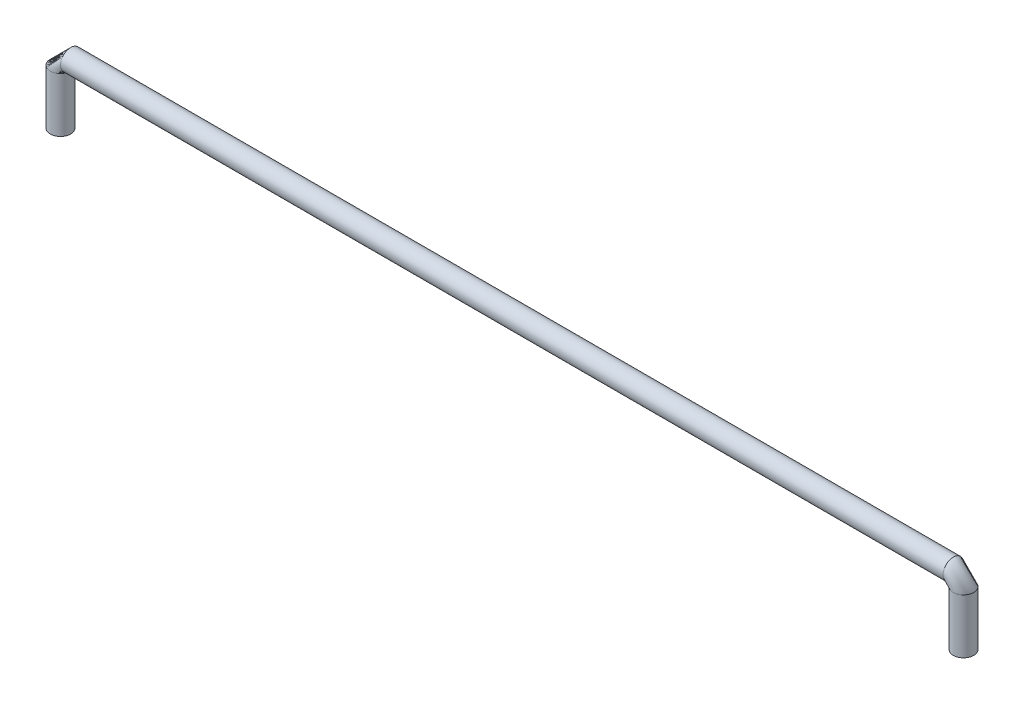
ISO-10303-21;
HEADER;
FILE_DESCRIPTION(('STEP AP214'),'2;1');
FILE_NAME('part.step','',(''),(''),'','','');
FILE_SCHEMA(('AUTOMOTIVE_DESIGN { 1 0 10303 214 1 1 1 1 }'));
ENDSEC;
DATA;
#1=APPLICATION_CONTEXT('core data for automotive mechanical design processes');
#2=APPLICATION_PROTOCOL_DEFINITION('international standard','automotive_design',2000,#1);
#3=PRODUCT_CONTEXT('',#1,'mechanical');
#4=PRODUCT('Part','Part','',(#3));
#5=PRODUCT_RELATED_PRODUCT_CATEGORY('part','',(#4));
#6=PRODUCT_DEFINITION_FORMATION('','',#4);
#7=PRODUCT_DEFINITION_CONTEXT('part definition',#1,'design');
#8=PRODUCT_DEFINITION('design','',#6,#7);
#9=PRODUCT_DEFINITION_SHAPE('','',#8);
#10=(LENGTH_UNIT() NAMED_UNIT(*) SI_UNIT(.MILLI.,.METRE.));
#11=(NAMED_UNIT(*) PLANE_ANGLE_UNIT() SI_UNIT($,.RADIAN.));
#12=(NAMED_UNIT(*) SI_UNIT($,.STERADIAN.) SOLID_ANGLE_UNIT());
#13=UNCERTAINTY_MEASURE_WITH_UNIT(LENGTH_MEASURE(1.E-05),#10,'distance_accuracy_value','');
#14=(GEOMETRIC_REPRESENTATION_CONTEXT(3) GLOBAL_UNCERTAINTY_ASSIGNED_CONTEXT((#13)) GLOBAL_UNIT_ASSIGNED_CONTEXT((#10,
#11,#12)) REPRESENTATION_CONTEXT('',''));
#15=CARTESIAN_POINT('',(0.,0.,0.));
#16=DIRECTION('',(0.,0.,1.));
#17=DIRECTION('',(1.,0.,0.));
#18=AXIS2_PLACEMENT_3D('',#15,#16,#17);
#19=CARTESIAN_POINT('',(67.31,-1.52400000000004,0.));
#20=DIRECTION('',(0.,-1.,0.));
#21=DIRECTION('',(0.,0.,-1.));
#22=AXIS2_PLACEMENT_3D('',#19,#20,#21);
#23=CYLINDRICAL_SURFACE('',#22,1.52399999999999);
#24=CARTESIAN_POINT('',(67.31,-9.65200000000002,0.));
#25=DIRECTION('',(0.,-1.,0.));
#26=DIRECTION('',(0.,0.,1.));
#27=AXIS2_PLACEMENT_3D('',#24,#25,#26);
#28=CIRCLE('',#27,1.52399999999999);
#29=CARTESIAN_POINT('',(67.31,-9.65200000000002,1.52399999999999));
#30=VERTEX_POINT('',#29);
#31=EDGE_CURVE('E11',#30,#30,#28,.T.);
#32=ORIENTED_EDGE('',*,*,#31,.F.);
#33=EDGE_LOOP('',(#32));
#34=FACE_BOUND('',#33,.T.);
#35=CARTESIAN_POINT('',(67.31,-1.52400000000004,0.));
#36=DIRECTION('',(0.,-1.,0.));
#37=DIRECTION('',(0.,0.,1.));
#38=AXIS2_PLACEMENT_3D('',#35,#36,#37);
#39=CIRCLE('',#38,1.52399999999999);
#40=CARTESIAN_POINT('',(65.786,-1.52400000000001,0.));
#41=VERTEX_POINT('',#40);
#42=EDGE_CURVE('E39',#41,#41,#39,.T.);
#43=ORIENTED_EDGE('',*,*,#42,.T.);
#44=EDGE_LOOP('',(#43));
#45=FACE_BOUND('',#44,.T.);
#46=ADVANCED_FACE('F32',(#34,#45),#23,.T.);
#47=CARTESIAN_POINT('',(65.786,-1.52400000000002,0.));
#48=DIRECTION('',(0.,0.,-1.));
#49=DIRECTION('',(-1.,0.,0.));
#50=AXIS2_PLACEMENT_3D('',#47,#48,#49);
#51=TOROIDAL_SURFACE('',#50,1.52400000000001,1.52399999999999);
#52=CARTESIAN_POINT('',(65.786,0.,0.));
#53=DIRECTION('',(1.,0.,0.));
#54=DIRECTION('',(0.,0.,1.));
#55=AXIS2_PLACEMENT_3D('',#52,#53,#54);
#56=CIRCLE('',#55,1.52399999999999);
#57=EDGE_CURVE('E53',#41,#41,#56,.T.);
#58=ORIENTED_EDGE('',*,*,#57,.T.);
#59=ORIENTED_EDGE('',*,*,#42,.F.);
#60=EDGE_LOOP('',(#58,#59));
#61=FACE_BOUND('',#60,.T.);
#62=ADVANCED_FACE('F65',(#61),#51,.T.);
#63=CARTESIAN_POINT('',(-65.786,0.,0.));
#64=DIRECTION('',(1.,0.,0.));
#65=DIRECTION('',(0.,1.,0.));
#66=AXIS2_PLACEMENT_3D('',#63,#64,#65);
#67=CYLINDRICAL_SURFACE('',#66,1.52399999999999);
#68=ORIENTED_EDGE('',*,*,#57,.F.);
#69=EDGE_LOOP('',(#68));
#70=FACE_BOUND('',#69,.T.);
#71=CARTESIAN_POINT('',(-65.786,0.,0.));
#72=DIRECTION('',(1.,0.,0.));
#73=DIRECTION('',(0.,0.,1.));
#74=AXIS2_PLACEMENT_3D('',#71,#72,#73);
#75=CIRCLE('',#74,1.52399999999999);
#76=CARTESIAN_POINT('',(-65.786,-1.52400000000001,0.));
#77=VERTEX_POINT('',#76);
#78=EDGE_CURVE('E48',#77,#77,#75,.T.);
#79=ORIENTED_EDGE('',*,*,#78,.T.);
#80=EDGE_LOOP('',(#79));
#81=FACE_BOUND('',#80,.T.);
#82=ADVANCED_FACE('F50',(#70,#81),#67,.T.);
#83=CARTESIAN_POINT('',(-65.786,-1.52400000000002,0.));
#84=DIRECTION('',(0.,0.,-1.));
#85=DIRECTION('',(-1.,0.,0.));
#86=AXIS2_PLACEMENT_3D('',#83,#84,#85);
#87=TOROIDAL_SURFACE('',#86,1.524,1.52399999999999);
#88=CARTESIAN_POINT('',(-67.31,-1.52400000000001,0.));
#89=DIRECTION('',(0.,1.,0.));
#90=DIRECTION('',(0.,0.,1.));
#91=AXIS2_PLACEMENT_3D('',#88,#89,#90);
#92=CIRCLE('',#91,1.52399999999999);
#93=EDGE_CURVE('E54',#77,#77,#92,.T.);
#94=ORIENTED_EDGE('',*,*,#93,.T.);
#95=ORIENTED_EDGE('',*,*,#78,.F.);
#96=EDGE_LOOP('',(#94,#95));
#97=FACE_BOUND('',#96,.T.);
#98=ADVANCED_FACE('F56',(#97),#87,.T.);
#99=CARTESIAN_POINT('',(-67.31,-1.52400000000001,0.));
#100=DIRECTION('',(0.,-1.,0.));
#101=DIRECTION('',(0.,0.,-1.));
#102=AXIS2_PLACEMENT_3D('',#99,#100,#101);
#103=CYLINDRICAL_SURFACE('',#102,1.52399999999999);
#104=ORIENTED_EDGE('',*,*,#93,.F.);
#105=EDGE_LOOP('',(#104));
#106=FACE_BOUND('',#105,.T.);
#107=CARTESIAN_POINT('',(-67.31,-9.652,0.));
#108=DIRECTION('',(0.,1.,0.));
#109=DIRECTION('',(0.,0.,1.));
#110=AXIS2_PLACEMENT_3D('',#107,#108,#109);
#111=CIRCLE('',#110,1.52399999999999);
#112=CARTESIAN_POINT('',(-67.31,-9.652,1.52399999999999));
#113=VERTEX_POINT('',#112);
#114=EDGE_CURVE('E58',#113,#113,#111,.T.);
#115=ORIENTED_EDGE('',*,*,#114,.T.);
#116=EDGE_LOOP('',(#115));
#117=FACE_BOUND('',#116,.T.);
#118=ADVANCED_FACE('F73',(#106,#117),#103,.T.);
#119=CARTESIAN_POINT('',(67.31,-9.65200000000002,0.));
#120=DIRECTION('',(0.,-1.,0.));
#121=DIRECTION('',(0.,0.,1.));
#122=AXIS2_PLACEMENT_3D('',#119,#120,#121);
#123=PLANE('',#122);
#124=ORIENTED_EDGE('',*,*,#31,.T.);
#125=EDGE_LOOP('',(#124));
#126=FACE_BOUND('',#125,.T.);
#127=ADVANCED_FACE('F81',(#126),#123,.T.);
#128=CARTESIAN_POINT('',(-67.31,-9.652,0.));
#129=DIRECTION('',(0.,1.,0.));
#130=DIRECTION('',(0.,0.,1.));
#131=AXIS2_PLACEMENT_3D('',#128,#129,#130);
#132=PLANE('',#131);
#133=ORIENTED_EDGE('',*,*,#114,.F.);
#134=EDGE_LOOP('',(#133));
#135=FACE_BOUND('',#134,.T.);
#136=ADVANCED_FACE('F83',(#135),#132,.F.);
#137=CLOSED_SHELL('',(#46,#62,#82,#98,#118,#127,#136));
#138=MANIFOLD_SOLID_BREP('B2',#137);
#139=ADVANCED_BREP_SHAPE_REPRESENTATION('',(#18,#138),#14);
#140=SHAPE_DEFINITION_REPRESENTATION(#9,#139);
ENDSEC;
END-ISO-10303-21;
